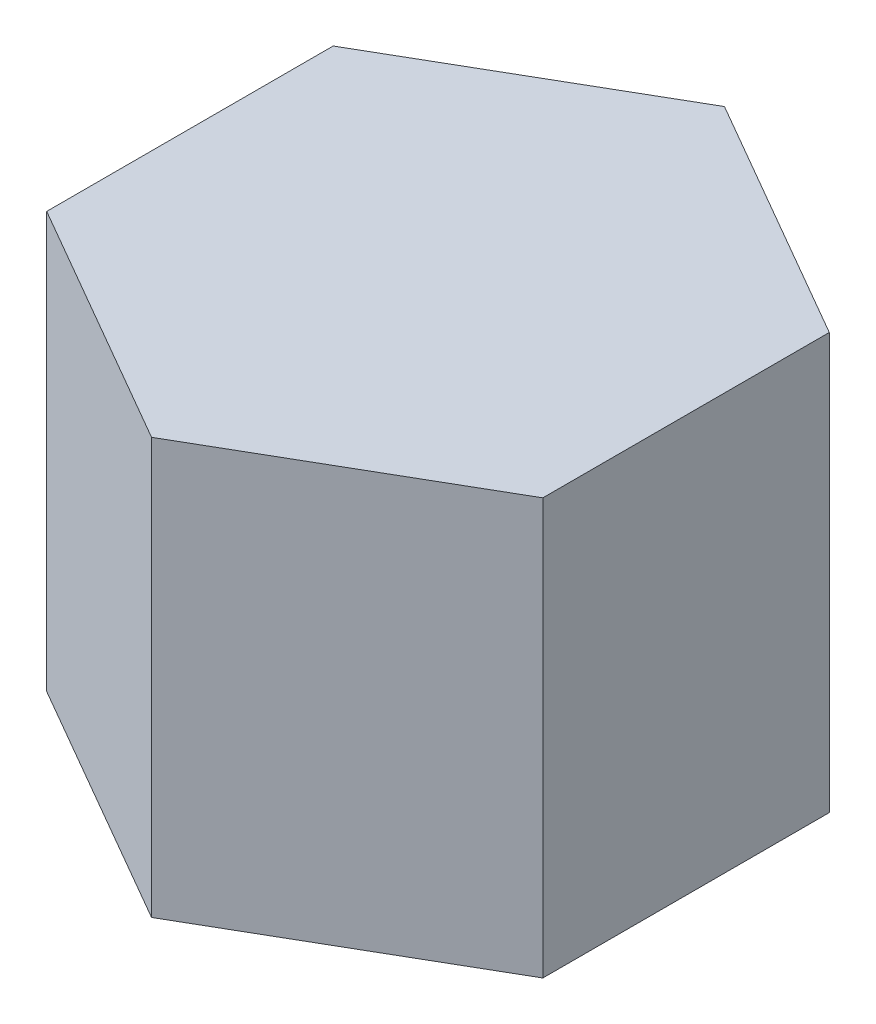
ISO-10303-21;
HEADER;
FILE_DESCRIPTION(('STEP AP214'),'2;1');
FILE_NAME('part.step','',(''),(''),'','','');
FILE_SCHEMA(('AUTOMOTIVE_DESIGN { 1 0 10303 214 1 1 1 1 }'));
ENDSEC;
DATA;
#1=APPLICATION_CONTEXT('core data for automotive mechanical design processes');
#2=APPLICATION_PROTOCOL_DEFINITION('international standard','automotive_design',2000,#1);
#3=PRODUCT_CONTEXT('',#1,'mechanical');
#4=PRODUCT('Part','Part','',(#3));
#5=PRODUCT_RELATED_PRODUCT_CATEGORY('part','',(#4));
#6=PRODUCT_DEFINITION_FORMATION('','',#4);
#7=PRODUCT_DEFINITION_CONTEXT('part definition',#1,'design');
#8=PRODUCT_DEFINITION('design','',#6,#7);
#9=PRODUCT_DEFINITION_SHAPE('','',#8);
#10=(LENGTH_UNIT() NAMED_UNIT(*) SI_UNIT(.MILLI.,.METRE.));
#11=(NAMED_UNIT(*) PLANE_ANGLE_UNIT() SI_UNIT($,.RADIAN.));
#12=(NAMED_UNIT(*) SI_UNIT($,.STERADIAN.) SOLID_ANGLE_UNIT());
#13=UNCERTAINTY_MEASURE_WITH_UNIT(LENGTH_MEASURE(1.E-05),#10,'distance_accuracy_value','');
#14=(GEOMETRIC_REPRESENTATION_CONTEXT(3) GLOBAL_UNCERTAINTY_ASSIGNED_CONTEXT((#13)) GLOBAL_UNIT_ASSIGNED_CONTEXT((#10,
#11,#12)) REPRESENTATION_CONTEXT('',''));
#15=CARTESIAN_POINT('',(0.,0.,0.));
#16=DIRECTION('',(0.,0.,1.));
#17=DIRECTION('',(1.,0.,0.));
#18=AXIS2_PLACEMENT_3D('',#15,#16,#17);
#19=CARTESIAN_POINT('',(203.142660308706,-148.537700895744,294.105047431848));
#20=DIRECTION('',(-0.500000000000028,0.,-0.866025403784423));
#21=DIRECTION('',(-0.866025403784423,0.,0.500000000000028));
#22=AXIS2_PLACEMENT_3D('',#19,#20,#21);
#23=PLANE('',#22);
#24=CARTESIAN_POINT('',(202.839551417382,-149.045793579175,294.280047431848));
#25=DIRECTION('',(0.866025403784422,0.,-0.500000000000028));
#26=VECTOR('',#25,1.);
#27=LINE('',#24,#26);
#28=CARTESIAN_POINT('',(202.839551417382,-149.045793579175,294.280047431848));
#29=VERTEX_POINT('',#28);
#30=CARTESIAN_POINT('',(203.142660308706,-149.045793579175,294.105047431848));
#31=VERTEX_POINT('',#30);
#32=EDGE_CURVE('E170',#29,#31,#27,.T.);
#33=ORIENTED_EDGE('',*,*,#32,.T.);
#34=CARTESIAN_POINT('',(203.142660308706,-148.537700895744,294.105047431848));
#35=DIRECTION('',(0.,-1.,0.));
#36=VECTOR('',#35,1.);
#37=LINE('',#34,#36);
#38=CARTESIAN_POINT('',(203.142660308706,-148.537700895744,294.105047431848));
#39=VERTEX_POINT('',#38);
#40=EDGE_CURVE('E35',#39,#31,#37,.T.);
#41=ORIENTED_EDGE('',*,*,#40,.F.);
#42=CARTESIAN_POINT('',(202.839551417382,-148.537700895744,294.280047431848));
#43=DIRECTION('',(0.866025403784422,0.,-0.500000000000028));
#44=VECTOR('',#43,1.);
#45=LINE('',#42,#44);
#46=CARTESIAN_POINT('',(202.839551417382,-148.537700895744,294.280047431848));
#47=VERTEX_POINT('',#46);
#48=EDGE_CURVE('E159',#47,#39,#45,.T.);
#49=ORIENTED_EDGE('',*,*,#48,.F.);
#50=CARTESIAN_POINT('',(202.839551417382,-148.537700895744,294.280047431848));
#51=DIRECTION('',(0.,-1.,0.));
#52=VECTOR('',#51,1.);
#53=LINE('',#50,#52);
#54=EDGE_CURVE('E10',#47,#29,#53,.T.);
#55=ORIENTED_EDGE('',*,*,#54,.T.);
#56=EDGE_LOOP('',(#33,#41,#49,#55));
#57=FACE_BOUND('',#56,.T.);
#58=ADVANCED_FACE('F16',(#57),#23,.F.);
#59=CARTESIAN_POINT('',(202.839551417382,-148.537700895744,294.280047431848));
#60=DIRECTION('',(0.499999999999978,0.,-0.866025403784452));
#61=DIRECTION('',(-0.866025403784452,0.,-0.499999999999978));
#62=AXIS2_PLACEMENT_3D('',#59,#60,#61);
#63=PLANE('',#62);
#64=CARTESIAN_POINT('',(202.536442526057,-149.045793579175,294.105047431848));
#65=DIRECTION('',(0.866025403784452,0.,0.499999999999978));
#66=VECTOR('',#65,1.);
#67=LINE('',#64,#66);
#68=CARTESIAN_POINT('',(202.536442526057,-149.045793579175,294.105047431848));
#69=VERTEX_POINT('',#68);
#70=EDGE_CURVE('E167',#69,#29,#67,.T.);
#71=ORIENTED_EDGE('',*,*,#70,.T.);
#72=ORIENTED_EDGE('',*,*,#54,.F.);
#73=CARTESIAN_POINT('',(202.536442526057,-148.537700895744,294.105047431848));
#74=DIRECTION('',(0.866025403784452,0.,0.499999999999978));
#75=VECTOR('',#74,1.);
#76=LINE('',#73,#75);
#77=CARTESIAN_POINT('',(202.536442526057,-148.537700895744,294.105047431848));
#78=VERTEX_POINT('',#77);
#79=EDGE_CURVE('E156',#78,#47,#76,.T.);
#80=ORIENTED_EDGE('',*,*,#79,.F.);
#81=CARTESIAN_POINT('',(202.536442526057,-148.537700895744,294.105047431848));
#82=DIRECTION('',(0.,-1.,0.));
#83=VECTOR('',#82,1.);
#84=LINE('',#81,#83);
#85=EDGE_CURVE('E27',#78,#69,#84,.T.);
#86=ORIENTED_EDGE('',*,*,#85,.T.);
#87=EDGE_LOOP('',(#71,#72,#80,#86));
#88=FACE_BOUND('',#87,.T.);
#89=ADVANCED_FACE('F189',(#88),#63,.F.);
#90=CARTESIAN_POINT('',(202.536442526057,-148.537700895744,290.831971220494));
#91=DIRECTION('',(1.,0.,0.));
#92=DIRECTION('',(0.,1.,0.));
#93=AXIS2_PLACEMENT_3D('',#90,#91,#92);
#94=PLANE('',#93);
#95=CARTESIAN_POINT('',(202.536442526057,-149.045793579175,293.755047431848));
#96=DIRECTION('',(0.,0.,1.));
#97=VECTOR('',#96,1.);
#98=LINE('',#95,#97);
#99=CARTESIAN_POINT('',(202.536442526057,-149.045793579175,293.755047431848));
#100=VERTEX_POINT('',#99);
#101=EDGE_CURVE('E163',#100,#69,#98,.T.);
#102=ORIENTED_EDGE('',*,*,#101,.T.);
#103=ORIENTED_EDGE('',*,*,#85,.F.);
#104=CARTESIAN_POINT('',(202.536442526057,-148.537700895744,293.755047431848));
#105=DIRECTION('',(0.,0.,1.));
#106=VECTOR('',#105,1.);
#107=LINE('',#104,#106);
#108=CARTESIAN_POINT('',(202.536442526057,-148.537700895744,293.755047431848));
#109=VERTEX_POINT('',#108);
#110=EDGE_CURVE('E106',#109,#78,#107,.T.);
#111=ORIENTED_EDGE('',*,*,#110,.F.);
#112=CARTESIAN_POINT('',(202.536442526057,-148.537700895744,293.755047431848));
#113=DIRECTION('',(0.,-1.,0.));
#114=VECTOR('',#113,1.);
#115=LINE('',#112,#114);
#116=EDGE_CURVE('E94',#109,#100,#115,.T.);
#117=ORIENTED_EDGE('',*,*,#116,.T.);
#118=EDGE_LOOP('',(#102,#103,#111,#117));
#119=FACE_BOUND('',#118,.T.);
#120=ADVANCED_FACE('F198',(#119),#94,.F.);
#121=CARTESIAN_POINT('',(202.536442526057,-148.537700895744,293.755047431848));
#122=DIRECTION('',(0.499999999999978,0.,0.866025403784452));
#123=DIRECTION('',(0.866025403784452,0.,-0.499999999999978));
#124=AXIS2_PLACEMENT_3D('',#121,#122,#123);
#125=PLANE('',#124);
#126=CARTESIAN_POINT('',(202.839551417382,-149.045793579175,293.580047431848));
#127=DIRECTION('',(-0.866025403784452,0.,0.499999999999978));
#128=VECTOR('',#127,1.);
#129=LINE('',#126,#128);
#130=CARTESIAN_POINT('',(202.839551417382,-149.045793579175,293.580047431848));
#131=VERTEX_POINT('',#130);
#132=EDGE_CURVE('E162',#131,#100,#129,.T.);
#133=ORIENTED_EDGE('',*,*,#132,.T.);
#134=ORIENTED_EDGE('',*,*,#116,.F.);
#135=CARTESIAN_POINT('',(202.839551417382,-148.537700895744,293.580047431848));
#136=DIRECTION('',(-0.866025403784452,0.,0.499999999999978));
#137=VECTOR('',#136,1.);
#138=LINE('',#135,#137);
#139=CARTESIAN_POINT('',(202.839551417382,-148.537700895744,293.580047431848));
#140=VERTEX_POINT('',#139);
#141=EDGE_CURVE('E98',#140,#109,#138,.T.);
#142=ORIENTED_EDGE('',*,*,#141,.F.);
#143=CARTESIAN_POINT('',(202.839551417382,-148.537700895744,293.580047431848));
#144=DIRECTION('',(0.,-1.,0.));
#145=VECTOR('',#144,1.);
#146=LINE('',#143,#145);
#147=EDGE_CURVE('E79',#140,#131,#146,.T.);
#148=ORIENTED_EDGE('',*,*,#147,.T.);
#149=EDGE_LOOP('',(#133,#134,#142,#148));
#150=FACE_BOUND('',#149,.T.);
#151=ADVANCED_FACE('F100',(#150),#125,.F.);
#152=CARTESIAN_POINT('',(202.839551417382,-148.537700895744,293.580047431848));
#153=DIRECTION('',(-0.500000000000062,0.,0.866025403784403));
#154=DIRECTION('',(0.866025403784403,0.,0.500000000000062));
#155=AXIS2_PLACEMENT_3D('',#152,#153,#154);
#156=PLANE('',#155);
#157=CARTESIAN_POINT('',(203.142660308706,-149.045793579175,293.755047431848));
#158=DIRECTION('',(-0.866025403784403,0.,-0.500000000000062));
#159=VECTOR('',#158,1.);
#160=LINE('',#157,#159);
#161=CARTESIAN_POINT('',(203.142660308706,-149.045793579175,293.755047431848));
#162=VERTEX_POINT('',#161);
#163=EDGE_CURVE('E88',#162,#131,#160,.T.);
#164=ORIENTED_EDGE('',*,*,#163,.T.);
#165=ORIENTED_EDGE('',*,*,#147,.F.);
#166=CARTESIAN_POINT('',(203.142660308706,-148.537700895744,293.755047431848));
#167=DIRECTION('',(-0.866025403784403,0.,-0.500000000000062));
#168=VECTOR('',#167,1.);
#169=LINE('',#166,#168);
#170=CARTESIAN_POINT('',(203.142660308706,-148.537700895744,293.755047431848));
#171=VERTEX_POINT('',#170);
#172=EDGE_CURVE('E84',#171,#140,#169,.T.);
#173=ORIENTED_EDGE('',*,*,#172,.F.);
#174=CARTESIAN_POINT('',(203.142660308706,-148.537700895744,293.755047431848));
#175=DIRECTION('',(0.,-1.,0.));
#176=VECTOR('',#175,1.);
#177=LINE('',#174,#176);
#178=EDGE_CURVE('E58',#171,#162,#177,.T.);
#179=ORIENTED_EDGE('',*,*,#178,.T.);
#180=EDGE_LOOP('',(#164,#165,#173,#179));
#181=FACE_BOUND('',#180,.T.);
#182=ADVANCED_FACE('F82',(#181),#156,.F.);
#183=CARTESIAN_POINT('',(203.142660308706,-148.537700895744,290.831971220494));
#184=DIRECTION('',(-1.,0.,0.));
#185=DIRECTION('',(0.,-1.,0.));
#186=AXIS2_PLACEMENT_3D('',#183,#184,#185);
#187=PLANE('',#186);
#188=CARTESIAN_POINT('',(203.142660308706,-149.045793579175,294.105047431848));
#189=DIRECTION('',(0.,0.,-1.));
#190=VECTOR('',#189,1.);
#191=LINE('',#188,#190);
#192=EDGE_CURVE('E160',#31,#162,#191,.T.);
#193=ORIENTED_EDGE('',*,*,#192,.T.);
#194=ORIENTED_EDGE('',*,*,#178,.F.);
#195=CARTESIAN_POINT('',(203.142660308706,-148.537700895744,294.105047431848));
#196=DIRECTION('',(0.,0.,-1.));
#197=VECTOR('',#196,1.);
#198=LINE('',#195,#197);
#199=EDGE_CURVE('E112',#39,#171,#198,.T.);
#200=ORIENTED_EDGE('',*,*,#199,.F.);
#201=ORIENTED_EDGE('',*,*,#40,.T.);
#202=EDGE_LOOP('',(#193,#194,#200,#201));
#203=FACE_BOUND('',#202,.T.);
#204=ADVANCED_FACE('F131',(#203),#187,.F.);
#205=CARTESIAN_POINT('',(206.339551417382,-148.537700895744,290.831971220494));
#206=DIRECTION('',(0.,-1.,0.));
#207=DIRECTION('',(1.,0.,0.));
#208=AXIS2_PLACEMENT_3D('',#205,#206,#207);
#209=PLANE('',#208);
#210=ORIENTED_EDGE('',*,*,#48,.T.);
#211=ORIENTED_EDGE('',*,*,#199,.T.);
#212=ORIENTED_EDGE('',*,*,#172,.T.);
#213=ORIENTED_EDGE('',*,*,#141,.T.);
#214=ORIENTED_EDGE('',*,*,#110,.T.);
#215=ORIENTED_EDGE('',*,*,#79,.T.);
#216=EDGE_LOOP('',(#210,#211,#212,#213,#214,#215));
#217=FACE_BOUND('',#216,.T.);
#218=ADVANCED_FACE('F111',(#217),#209,.F.);
#219=CARTESIAN_POINT('',(206.339551417382,-149.045793579175,290.831971220494));
#220=DIRECTION('',(0.,-1.,0.));
#221=DIRECTION('',(1.,0.,0.));
#222=AXIS2_PLACEMENT_3D('',#219,#220,#221);
#223=PLANE('',#222);
#224=ORIENTED_EDGE('',*,*,#32,.F.);
#225=ORIENTED_EDGE('',*,*,#70,.F.);
#226=ORIENTED_EDGE('',*,*,#101,.F.);
#227=ORIENTED_EDGE('',*,*,#132,.F.);
#228=ORIENTED_EDGE('',*,*,#163,.F.);
#229=ORIENTED_EDGE('',*,*,#192,.F.);
#230=EDGE_LOOP('',(#224,#225,#226,#227,#228,#229));
#231=FACE_BOUND('',#230,.T.);
#232=ADVANCED_FACE('F130',(#231),#223,.T.);
#233=CLOSED_SHELL('',(#58,#89,#120,#151,#182,#204,#218,#232));
#234=MANIFOLD_SOLID_BREP('B1',#233);
#235=ADVANCED_BREP_SHAPE_REPRESENTATION('',(#18,#234),#14);
#236=SHAPE_DEFINITION_REPRESENTATION(#9,#235);
ENDSEC;
END-ISO-10303-21;
